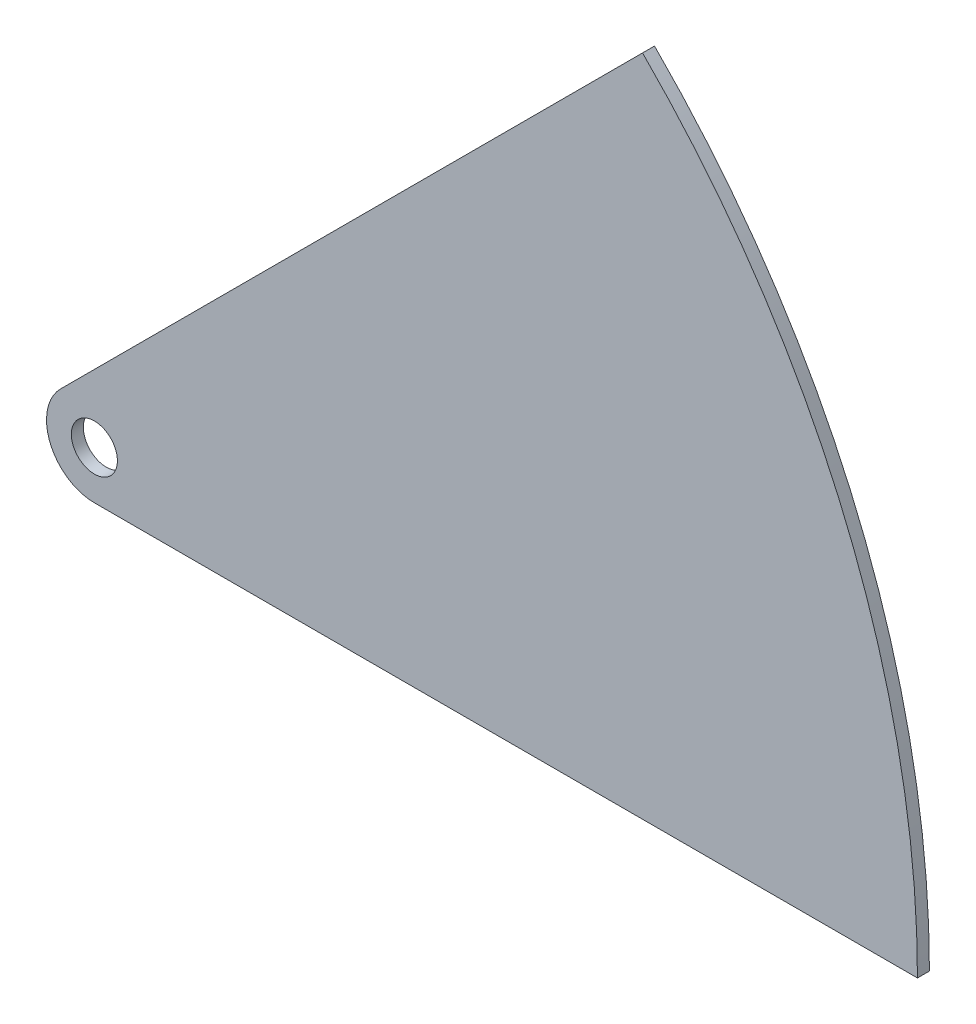
ISO-10303-21;
HEADER;
FILE_DESCRIPTION(('STEP AP214'),'2;1');
FILE_NAME('part.step','',(''),(''),'','','');
FILE_SCHEMA(('AUTOMOTIVE_DESIGN { 1 0 10303 214 1 1 1 1 }'));
ENDSEC;
DATA;
#1=APPLICATION_CONTEXT('core data for automotive mechanical design processes');
#2=APPLICATION_PROTOCOL_DEFINITION('international standard','automotive_design',2000,#1);
#3=PRODUCT_CONTEXT('',#1,'mechanical');
#4=PRODUCT('Part','Part','',(#3));
#5=PRODUCT_RELATED_PRODUCT_CATEGORY('part','',(#4));
#6=PRODUCT_DEFINITION_FORMATION('','',#4);
#7=PRODUCT_DEFINITION_CONTEXT('part definition',#1,'design');
#8=PRODUCT_DEFINITION('design','',#6,#7);
#9=PRODUCT_DEFINITION_SHAPE('','',#8);
#10=(LENGTH_UNIT() NAMED_UNIT(*) SI_UNIT(.MILLI.,.METRE.));
#11=(NAMED_UNIT(*) PLANE_ANGLE_UNIT() SI_UNIT($,.RADIAN.));
#12=(NAMED_UNIT(*) SI_UNIT($,.STERADIAN.) SOLID_ANGLE_UNIT());
#13=UNCERTAINTY_MEASURE_WITH_UNIT(LENGTH_MEASURE(1.E-05),#10,'distance_accuracy_value','');
#14=(GEOMETRIC_REPRESENTATION_CONTEXT(3) GLOBAL_UNCERTAINTY_ASSIGNED_CONTEXT((#13)) GLOBAL_UNIT_ASSIGNED_CONTEXT((#10,
#11,#12)) REPRESENTATION_CONTEXT('',''));
#15=CARTESIAN_POINT('',(0.,0.,0.));
#16=DIRECTION('',(0.,0.,1.));
#17=DIRECTION('',(1.,0.,0.));
#18=AXIS2_PLACEMENT_3D('',#15,#16,#17);
#19=CARTESIAN_POINT('',(-30.6605122421384,-12.7,3.175));
#20=DIRECTION('',(0.,0.,1.));
#21=DIRECTION('',(1.,0.,0.));
#22=AXIS2_PLACEMENT_3D('',#19,#20,#21);
#23=PLANE('',#22);
#24=CARTESIAN_POINT('',(-30.6605122421384,-12.7,3.175));
#25=DIRECTION('',(0.,0.,1.));
#26=DIRECTION('',(1.,0.,0.));
#27=AXIS2_PLACEMENT_3D('',#24,#25,#26);
#28=CIRCLE('',#27,249.100512242138);
#29=CARTESIAN_POINT('',(218.44,-12.7,3.175));
#30=VERTEX_POINT('',#29);
#31=CARTESIAN_POINT('',(145.480149161321,163.440661403458,3.175));
#32=VERTEX_POINT('',#31);
#33=EDGE_CURVE('E98',#30,#32,#28,.T.);
#34=ORIENTED_EDGE('',*,*,#33,.T.);
#35=DIRECTION('',(-0.707106781186551,-0.707106781186544,0.));
#36=VECTOR('',#35,1.);
#37=CARTESIAN_POINT('',(-8.98025612106911,8.9802561210692,3.175));
#38=LINE('',#37,#36);
#39=CARTESIAN_POINT('',(-8.98025612106911,8.9802561210692,3.175));
#40=VERTEX_POINT('',#39);
#41=EDGE_CURVE('E93',#32,#40,#38,.T.);
#42=ORIENTED_EDGE('',*,*,#41,.T.);
#43=CARTESIAN_POINT('',(0.,0.,3.175));
#44=DIRECTION('',(0.,0.,1.));
#45=DIRECTION('',(1.,0.,0.));
#46=AXIS2_PLACEMENT_3D('',#43,#44,#45);
#47=CIRCLE('',#46,12.7);
#48=CARTESIAN_POINT('',(0.,-12.7,3.175));
#49=VERTEX_POINT('',#48);
#50=EDGE_CURVE('E96',#40,#49,#47,.T.);
#51=ORIENTED_EDGE('',*,*,#50,.T.);
#52=DIRECTION('',(1.,0.,0.));
#53=VECTOR('',#52,1.);
#54=CARTESIAN_POINT('',(218.44,-12.7,3.175));
#55=LINE('',#54,#53);
#56=EDGE_CURVE('E63',#49,#30,#55,.T.);
#57=ORIENTED_EDGE('',*,*,#56,.T.);
#58=EDGE_LOOP('',(#34,#42,#51,#57));
#59=FACE_BOUND('',#58,.T.);
#60=CARTESIAN_POINT('',(0.,0.,3.175));
#61=DIRECTION('',(0.,0.,1.));
#62=DIRECTION('',(1.,0.,0.));
#63=AXIS2_PLACEMENT_3D('',#60,#61,#62);
#64=CIRCLE('',#63,6.10870000000001);
#65=CARTESIAN_POINT('',(6.10870000000001,0.,3.175));
#66=VERTEX_POINT('',#65);
#67=EDGE_CURVE('E118',#66,#66,#64,.T.);
#68=ORIENTED_EDGE('',*,*,#67,.F.);
#69=EDGE_LOOP('',(#68));
#70=FACE_BOUND('',#69,.T.);
#71=ADVANCED_FACE('F45',(#59,#70),#23,.T.);
#72=CARTESIAN_POINT('',(-30.6605122421384,-12.7,0.));
#73=DIRECTION('',(0.,0.,1.));
#74=DIRECTION('',(1.,0.,0.));
#75=AXIS2_PLACEMENT_3D('',#72,#73,#74);
#76=PLANE('',#75);
#77=CARTESIAN_POINT('',(-30.6605122421384,-12.7,0.));
#78=DIRECTION('',(0.,0.,1.));
#79=DIRECTION('',(1.,0.,0.));
#80=AXIS2_PLACEMENT_3D('',#77,#78,#79);
#81=CIRCLE('',#80,249.100512242138);
#82=CARTESIAN_POINT('',(218.44,-12.7,0.));
#83=VERTEX_POINT('',#82);
#84=CARTESIAN_POINT('',(145.480149161321,163.440661403458,0.));
#85=VERTEX_POINT('',#84);
#86=EDGE_CURVE('E114',#83,#85,#81,.T.);
#87=ORIENTED_EDGE('',*,*,#86,.F.);
#88=DIRECTION('',(1.,0.,0.));
#89=VECTOR('',#88,1.);
#90=CARTESIAN_POINT('',(218.44,-12.7,0.));
#91=LINE('',#90,#89);
#92=CARTESIAN_POINT('',(0.,-12.7,0.));
#93=VERTEX_POINT('',#92);
#94=EDGE_CURVE('E86',#93,#83,#91,.T.);
#95=ORIENTED_EDGE('',*,*,#94,.F.);
#96=CARTESIAN_POINT('',(0.,0.,0.));
#97=DIRECTION('',(0.,0.,1.));
#98=DIRECTION('',(1.,0.,0.));
#99=AXIS2_PLACEMENT_3D('',#96,#97,#98);
#100=CIRCLE('',#99,12.7);
#101=CARTESIAN_POINT('',(-8.98025612106911,8.9802561210692,0.));
#102=VERTEX_POINT('',#101);
#103=EDGE_CURVE('E80',#102,#93,#100,.T.);
#104=ORIENTED_EDGE('',*,*,#103,.F.);
#105=DIRECTION('',(-0.707106781186551,-0.707106781186544,0.));
#106=VECTOR('',#105,1.);
#107=CARTESIAN_POINT('',(-8.98025612106911,8.9802561210692,0.));
#108=LINE('',#107,#106);
#109=EDGE_CURVE('E103',#85,#102,#108,.T.);
#110=ORIENTED_EDGE('',*,*,#109,.F.);
#111=EDGE_LOOP('',(#87,#95,#104,#110));
#112=FACE_BOUND('',#111,.T.);
#113=CARTESIAN_POINT('',(0.,0.,0.));
#114=DIRECTION('',(0.,0.,1.));
#115=DIRECTION('',(1.,0.,0.));
#116=AXIS2_PLACEMENT_3D('',#113,#114,#115);
#117=CIRCLE('',#116,6.10870000000001);
#118=CARTESIAN_POINT('',(6.10870000000001,0.,0.));
#119=VERTEX_POINT('',#118);
#120=EDGE_CURVE('E136',#119,#119,#117,.T.);
#121=ORIENTED_EDGE('',*,*,#120,.T.);
#122=EDGE_LOOP('',(#121));
#123=FACE_BOUND('',#122,.T.);
#124=ADVANCED_FACE('F131',(#112,#123),#76,.F.);
#125=CARTESIAN_POINT('',(-30.6605122421384,-12.7,3.175));
#126=DIRECTION('',(0.,0.,-1.));
#127=DIRECTION('',(-1.,0.,0.));
#128=AXIS2_PLACEMENT_3D('',#125,#126,#127);
#129=CYLINDRICAL_SURFACE('',#128,249.100512242138);
#130=ORIENTED_EDGE('',*,*,#86,.T.);
#131=DIRECTION('',(0.,0.,-1.));
#132=VECTOR('',#131,1.);
#133=CARTESIAN_POINT('',(145.480149161321,163.440661403458,3.175));
#134=LINE('',#133,#132);
#135=EDGE_CURVE('E11',#32,#85,#134,.T.);
#136=ORIENTED_EDGE('',*,*,#135,.F.);
#137=ORIENTED_EDGE('',*,*,#33,.F.);
#138=DIRECTION('',(0.,0.,-1.));
#139=VECTOR('',#138,1.);
#140=CARTESIAN_POINT('',(218.44,-12.7,3.175));
#141=LINE('',#140,#139);
#142=EDGE_CURVE('E110',#30,#83,#141,.T.);
#143=ORIENTED_EDGE('',*,*,#142,.T.);
#144=EDGE_LOOP('',(#130,#136,#137,#143));
#145=FACE_BOUND('',#144,.T.);
#146=ADVANCED_FACE('F47',(#145),#129,.T.);
#147=CARTESIAN_POINT('',(-8.98025612106911,8.9802561210692,3.175));
#148=DIRECTION('',(0.707106781186544,-0.707106781186551,0.));
#149=DIRECTION('',(0.707106781186551,0.707106781186544,0.));
#150=AXIS2_PLACEMENT_3D('',#147,#148,#149);
#151=PLANE('',#150);
#152=ORIENTED_EDGE('',*,*,#109,.T.);
#153=DIRECTION('',(0.,0.,-1.));
#154=VECTOR('',#153,1.);
#155=CARTESIAN_POINT('',(-8.98025612106911,8.9802561210692,3.175));
#156=LINE('',#155,#154);
#157=EDGE_CURVE('E55',#40,#102,#156,.T.);
#158=ORIENTED_EDGE('',*,*,#157,.F.);
#159=ORIENTED_EDGE('',*,*,#41,.F.);
#160=ORIENTED_EDGE('',*,*,#135,.T.);
#161=EDGE_LOOP('',(#152,#158,#159,#160));
#162=FACE_BOUND('',#161,.T.);
#163=ADVANCED_FACE('F102',(#162),#151,.F.);
#164=CARTESIAN_POINT('',(0.,0.,3.175));
#165=DIRECTION('',(0.,0.,-1.));
#166=DIRECTION('',(-1.,0.,0.));
#167=AXIS2_PLACEMENT_3D('',#164,#165,#166);
#168=CYLINDRICAL_SURFACE('',#167,12.7);
#169=ORIENTED_EDGE('',*,*,#103,.T.);
#170=DIRECTION('',(0.,0.,-1.));
#171=VECTOR('',#170,1.);
#172=CARTESIAN_POINT('',(0.,-12.7,3.175));
#173=LINE('',#172,#171);
#174=EDGE_CURVE('E105',#49,#93,#173,.T.);
#175=ORIENTED_EDGE('',*,*,#174,.F.);
#176=ORIENTED_EDGE('',*,*,#50,.F.);
#177=ORIENTED_EDGE('',*,*,#157,.T.);
#178=EDGE_LOOP('',(#169,#175,#176,#177));
#179=FACE_BOUND('',#178,.T.);
#180=ADVANCED_FACE('F106',(#179),#168,.T.);
#181=CARTESIAN_POINT('',(218.44,-12.7,3.175));
#182=DIRECTION('',(0.,1.,0.));
#183=DIRECTION('',(-1.,0.,0.));
#184=AXIS2_PLACEMENT_3D('',#181,#182,#183);
#185=PLANE('',#184);
#186=ORIENTED_EDGE('',*,*,#94,.T.);
#187=ORIENTED_EDGE('',*,*,#142,.F.);
#188=ORIENTED_EDGE('',*,*,#56,.F.);
#189=ORIENTED_EDGE('',*,*,#174,.T.);
#190=EDGE_LOOP('',(#186,#187,#188,#189));
#191=FACE_BOUND('',#190,.T.);
#192=ADVANCED_FACE('F128',(#191),#185,.F.);
#193=CARTESIAN_POINT('',(0.,0.,3.175));
#194=DIRECTION('',(0.,0.,-1.));
#195=DIRECTION('',(-1.,0.,0.));
#196=AXIS2_PLACEMENT_3D('',#193,#194,#195);
#197=CYLINDRICAL_SURFACE('',#196,6.10870000000001);
#198=ORIENTED_EDGE('',*,*,#67,.T.);
#199=EDGE_LOOP('',(#198));
#200=FACE_BOUND('',#199,.T.);
#201=ORIENTED_EDGE('',*,*,#120,.F.);
#202=EDGE_LOOP('',(#201));
#203=FACE_BOUND('',#202,.T.);
#204=ADVANCED_FACE('F144',(#200,#203),#197,.F.);
#205=CLOSED_SHELL('',(#71,#124,#146,#163,#180,#192,#204));
#206=MANIFOLD_SOLID_BREP('B2',#205);
#207=ADVANCED_BREP_SHAPE_REPRESENTATION('',(#18,#206),#14);
#208=SHAPE_DEFINITION_REPRESENTATION(#9,#207);
ENDSEC;
END-ISO-10303-21;
